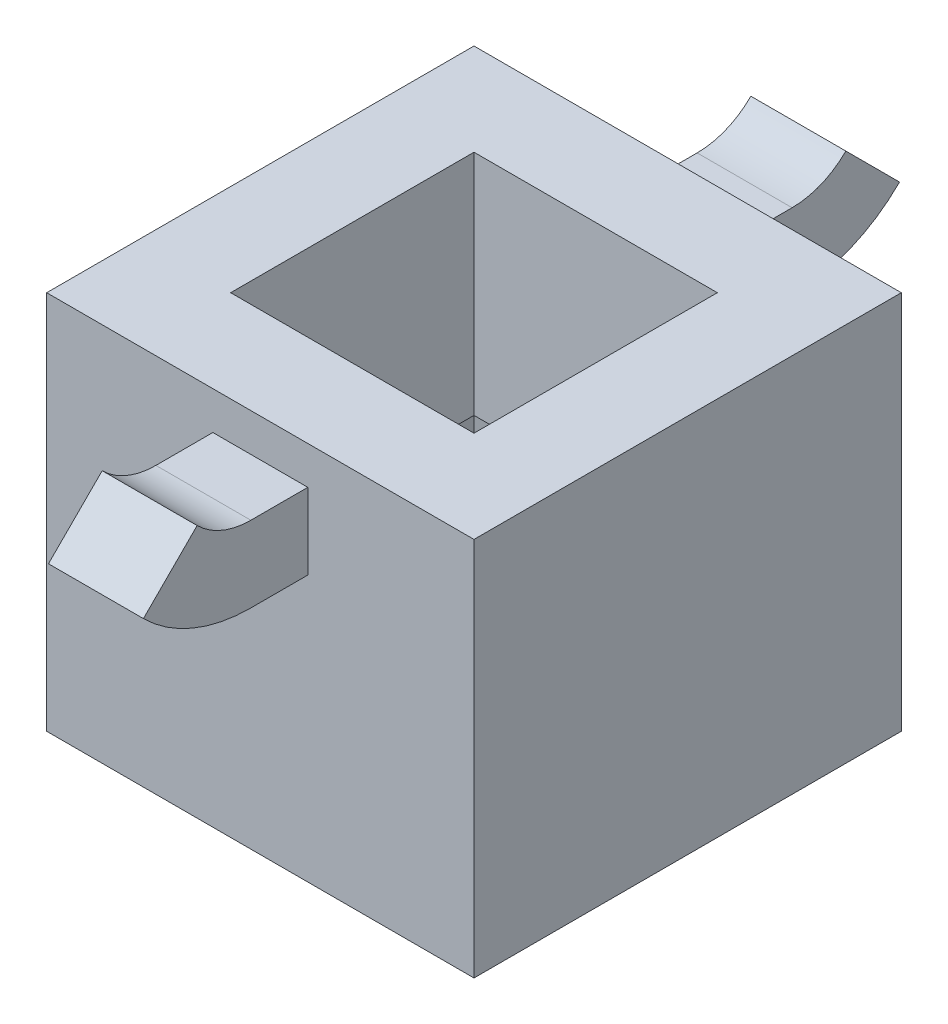
ISO-10303-21;
HEADER;
FILE_DESCRIPTION(('STEP AP214'),'2;1');
FILE_NAME('part.step','',(''),(''),'','','');
FILE_SCHEMA(('AUTOMOTIVE_DESIGN { 1 0 10303 214 1 1 1 1 }'));
ENDSEC;
DATA;
#1=APPLICATION_CONTEXT('core data for automotive mechanical design processes');
#2=APPLICATION_PROTOCOL_DEFINITION('international standard','automotive_design',2000,#1);
#3=PRODUCT_CONTEXT('',#1,'mechanical');
#4=PRODUCT('Part','Part','',(#3));
#5=PRODUCT_RELATED_PRODUCT_CATEGORY('part','',(#4));
#6=PRODUCT_DEFINITION_FORMATION('','',#4);
#7=PRODUCT_DEFINITION_CONTEXT('part definition',#1,'design');
#8=PRODUCT_DEFINITION('design','',#6,#7);
#9=PRODUCT_DEFINITION_SHAPE('','',#8);
#10=(LENGTH_UNIT() NAMED_UNIT(*) SI_UNIT(.MILLI.,.METRE.));
#11=(NAMED_UNIT(*) PLANE_ANGLE_UNIT() SI_UNIT($,.RADIAN.));
#12=(NAMED_UNIT(*) SI_UNIT($,.STERADIAN.) SOLID_ANGLE_UNIT());
#13=UNCERTAINTY_MEASURE_WITH_UNIT(LENGTH_MEASURE(1.E-05),#10,'distance_accuracy_value','');
#14=(GEOMETRIC_REPRESENTATION_CONTEXT(3) GLOBAL_UNCERTAINTY_ASSIGNED_CONTEXT((#13)) GLOBAL_UNIT_ASSIGNED_CONTEXT((#10,
#11,#12)) REPRESENTATION_CONTEXT('',''));
#15=CARTESIAN_POINT('',(0.,0.,0.));
#16=DIRECTION('',(0.,0.,1.));
#17=DIRECTION('',(1.,0.,0.));
#18=AXIS2_PLACEMENT_3D('',#15,#16,#17);
#19=CARTESIAN_POINT('',(11.25,20.,-11.25));
#20=DIRECTION('',(0.,0.,1.));
#21=DIRECTION('',(1.,0.,0.));
#22=AXIS2_PLACEMENT_3D('',#19,#20,#21);
#23=PLANE('',#22);
#24=DIRECTION('',(-1.,0.,0.));
#25=VECTOR('',#24,1.);
#26=CARTESIAN_POINT('',(11.25,0.,-11.25));
#27=LINE('',#26,#25);
#28=CARTESIAN_POINT('',(11.25,0.,-11.25));
#29=VERTEX_POINT('',#28);
#30=CARTESIAN_POINT('',(-11.25,0.,-11.25));
#31=VERTEX_POINT('',#30);
#32=EDGE_CURVE('E398',#29,#31,#27,.T.);
#33=ORIENTED_EDGE('',*,*,#32,.T.);
#34=DIRECTION('',(0.,-1.,0.));
#35=VECTOR('',#34,1.);
#36=CARTESIAN_POINT('',(-11.25,20.,-11.25));
#37=LINE('',#36,#35);
#38=CARTESIAN_POINT('',(-11.25,20.,-11.25));
#39=VERTEX_POINT('',#38);
#40=EDGE_CURVE('E404',#39,#31,#37,.T.);
#41=ORIENTED_EDGE('',*,*,#40,.F.);
#42=DIRECTION('',(-1.,0.,0.));
#43=VECTOR('',#42,1.);
#44=CARTESIAN_POINT('',(11.25,20.,-11.25));
#45=LINE('',#44,#43);
#46=CARTESIAN_POINT('',(11.25,20.,-11.25));
#47=VERTEX_POINT('',#46);
#48=EDGE_CURVE('E402',#47,#39,#45,.T.);
#49=ORIENTED_EDGE('',*,*,#48,.F.);
#50=DIRECTION('',(0.,-1.,0.));
#51=VECTOR('',#50,1.);
#52=CARTESIAN_POINT('',(11.25,20.,-11.25));
#53=LINE('',#52,#51);
#54=EDGE_CURVE('E414',#47,#29,#53,.T.);
#55=ORIENTED_EDGE('',*,*,#54,.T.);
#56=EDGE_LOOP('',(#33,#41,#49,#55));
#57=FACE_BOUND('',#56,.T.);
#58=DIRECTION('',(0.,-1.,0.));
#59=VECTOR('',#58,1.);
#60=CARTESIAN_POINT('',(2.50000000000001,18.,-11.25));
#61=LINE('',#60,#59);
#62=CARTESIAN_POINT('',(2.50000000000001,18.,-11.25));
#63=VERTEX_POINT('',#62);
#64=CARTESIAN_POINT('',(2.50000000000001,14.,-11.25));
#65=VERTEX_POINT('',#64);
#66=EDGE_CURVE('E339',#63,#65,#61,.T.);
#67=ORIENTED_EDGE('',*,*,#66,.F.);
#68=DIRECTION('',(1.,0.,0.));
#69=VECTOR('',#68,1.);
#70=CARTESIAN_POINT('',(-2.49999999999999,18.,-11.25));
#71=LINE('',#70,#69);
#72=CARTESIAN_POINT('',(-2.5,18.,-11.25));
#73=VERTEX_POINT('',#72);
#74=EDGE_CURVE('E344',#73,#63,#71,.T.);
#75=ORIENTED_EDGE('',*,*,#74,.F.);
#76=DIRECTION('',(0.,1.,0.));
#77=VECTOR('',#76,1.);
#78=CARTESIAN_POINT('',(-2.49999999999999,18.,-11.25));
#79=LINE('',#78,#77);
#80=CARTESIAN_POINT('',(-2.5,14.,-11.25));
#81=VERTEX_POINT('',#80);
#82=EDGE_CURVE('E353',#81,#73,#79,.T.);
#83=ORIENTED_EDGE('',*,*,#82,.F.);
#84=DIRECTION('',(-1.,0.,0.));
#85=VECTOR('',#84,1.);
#86=CARTESIAN_POINT('',(-2.49999999999999,14.,-11.25));
#87=LINE('',#86,#85);
#88=EDGE_CURVE('E350',#65,#81,#87,.T.);
#89=ORIENTED_EDGE('',*,*,#88,.F.);
#90=EDGE_LOOP('',(#67,#75,#83,#89));
#91=FACE_BOUND('',#90,.T.);
#92=ADVANCED_FACE('F33',(#57,#91),#23,.F.);
#93=CARTESIAN_POINT('',(-11.25,20.,11.25));
#94=DIRECTION('',(1.,0.,0.));
#95=DIRECTION('',(0.,0.,-1.));
#96=AXIS2_PLACEMENT_3D('',#93,#94,#95);
#97=PLANE('',#96);
#98=DIRECTION('',(0.,0.,1.));
#99=VECTOR('',#98,1.);
#100=CARTESIAN_POINT('',(-11.25,0.,11.25));
#101=LINE('',#100,#99);
#102=CARTESIAN_POINT('',(-11.25,0.,11.25));
#103=VERTEX_POINT('',#102);
#104=EDGE_CURVE('E393',#31,#103,#101,.T.);
#105=ORIENTED_EDGE('',*,*,#104,.T.);
#106=DIRECTION('',(0.,-1.,0.));
#107=VECTOR('',#106,1.);
#108=CARTESIAN_POINT('',(-11.25,20.,11.25));
#109=LINE('',#108,#107);
#110=CARTESIAN_POINT('',(-11.25,20.,11.25));
#111=VERTEX_POINT('',#110);
#112=EDGE_CURVE('E11',#111,#103,#109,.T.);
#113=ORIENTED_EDGE('',*,*,#112,.F.);
#114=DIRECTION('',(0.,0.,1.));
#115=VECTOR('',#114,1.);
#116=CARTESIAN_POINT('',(-11.25,20.,11.25));
#117=LINE('',#116,#115);
#118=EDGE_CURVE('E394',#39,#111,#117,.T.);
#119=ORIENTED_EDGE('',*,*,#118,.F.);
#120=ORIENTED_EDGE('',*,*,#40,.T.);
#121=EDGE_LOOP('',(#105,#113,#119,#120));
#122=FACE_BOUND('',#121,.T.);
#123=ADVANCED_FACE('F35',(#122),#97,.F.);
#124=CARTESIAN_POINT('',(11.25,20.,11.25));
#125=DIRECTION('',(0.,0.,-1.));
#126=DIRECTION('',(-1.,0.,0.));
#127=AXIS2_PLACEMENT_3D('',#124,#125,#126);
#128=PLANE('',#127);
#129=DIRECTION('',(1.,0.,0.));
#130=VECTOR('',#129,1.);
#131=CARTESIAN_POINT('',(-2.49999999999999,18.,11.25));
#132=LINE('',#131,#130);
#133=CARTESIAN_POINT('',(-2.49999999999999,18.,11.25));
#134=VERTEX_POINT('',#133);
#135=CARTESIAN_POINT('',(2.50000000000001,18.,11.25));
#136=VERTEX_POINT('',#135);
#137=EDGE_CURVE('E303',#134,#136,#132,.T.);
#138=ORIENTED_EDGE('',*,*,#137,.T.);
#139=DIRECTION('',(0.,-1.,0.));
#140=VECTOR('',#139,1.);
#141=CARTESIAN_POINT('',(2.50000000000001,18.,11.25));
#142=LINE('',#141,#140);
#143=CARTESIAN_POINT('',(2.5,14.,11.25));
#144=VERTEX_POINT('',#143);
#145=EDGE_CURVE('E275',#136,#144,#142,.T.);
#146=ORIENTED_EDGE('',*,*,#145,.T.);
#147=DIRECTION('',(-1.,0.,0.));
#148=VECTOR('',#147,1.);
#149=CARTESIAN_POINT('',(-2.49999999999999,14.,11.25));
#150=LINE('',#149,#148);
#151=CARTESIAN_POINT('',(-2.5,14.,11.25));
#152=VERTEX_POINT('',#151);
#153=EDGE_CURVE('E297',#144,#152,#150,.T.);
#154=ORIENTED_EDGE('',*,*,#153,.T.);
#155=DIRECTION('',(0.,1.,0.));
#156=VECTOR('',#155,1.);
#157=CARTESIAN_POINT('',(-2.49999999999999,18.,11.25));
#158=LINE('',#157,#156);
#159=EDGE_CURVE('E306',#152,#134,#158,.T.);
#160=ORIENTED_EDGE('',*,*,#159,.T.);
#161=EDGE_LOOP('',(#138,#146,#154,#160));
#162=FACE_BOUND('',#161,.T.);
#163=DIRECTION('',(1.,0.,0.));
#164=VECTOR('',#163,1.);
#165=CARTESIAN_POINT('',(11.25,0.,11.25));
#166=LINE('',#165,#164);
#167=CARTESIAN_POINT('',(11.25,0.,11.25));
#168=VERTEX_POINT('',#167);
#169=EDGE_CURVE('E407',#103,#168,#166,.T.);
#170=ORIENTED_EDGE('',*,*,#169,.T.);
#171=DIRECTION('',(0.,-1.,0.));
#172=VECTOR('',#171,1.);
#173=CARTESIAN_POINT('',(11.25,20.,11.25));
#174=LINE('',#173,#172);
#175=CARTESIAN_POINT('',(11.25,20.,11.25));
#176=VERTEX_POINT('',#175);
#177=EDGE_CURVE('E41',#176,#168,#174,.T.);
#178=ORIENTED_EDGE('',*,*,#177,.F.);
#179=DIRECTION('',(1.,0.,0.));
#180=VECTOR('',#179,1.);
#181=CARTESIAN_POINT('',(11.25,20.,11.25));
#182=LINE('',#181,#180);
#183=EDGE_CURVE('E397',#111,#176,#182,.T.);
#184=ORIENTED_EDGE('',*,*,#183,.F.);
#185=ORIENTED_EDGE('',*,*,#112,.T.);
#186=EDGE_LOOP('',(#170,#178,#184,#185));
#187=FACE_BOUND('',#186,.T.);
#188=ADVANCED_FACE('F435',(#162,#187),#128,.F.);
#189=CARTESIAN_POINT('',(11.25,20.,11.25));
#190=DIRECTION('',(-1.,0.,0.));
#191=DIRECTION('',(0.,0.,1.));
#192=AXIS2_PLACEMENT_3D('',#189,#190,#191);
#193=PLANE('',#192);
#194=DIRECTION('',(0.,0.,-1.));
#195=VECTOR('',#194,1.);
#196=CARTESIAN_POINT('',(11.25,0.,11.25));
#197=LINE('',#196,#195);
#198=EDGE_CURVE('E409',#168,#29,#197,.T.);
#199=ORIENTED_EDGE('',*,*,#198,.T.);
#200=ORIENTED_EDGE('',*,*,#54,.F.);
#201=DIRECTION('',(0.,0.,-1.));
#202=VECTOR('',#201,1.);
#203=CARTESIAN_POINT('',(11.25,20.,11.25));
#204=LINE('',#203,#202);
#205=EDGE_CURVE('E400',#176,#47,#204,.T.);
#206=ORIENTED_EDGE('',*,*,#205,.F.);
#207=ORIENTED_EDGE('',*,*,#177,.T.);
#208=EDGE_LOOP('',(#199,#200,#206,#207));
#209=FACE_BOUND('',#208,.T.);
#210=ADVANCED_FACE('F421',(#209),#193,.F.);
#211=CARTESIAN_POINT('',(0.,20.,0.));
#212=DIRECTION('',(0.,1.,0.));
#213=DIRECTION('',(0.,0.,1.));
#214=AXIS2_PLACEMENT_3D('',#211,#212,#213);
#215=PLANE('',#214);
#216=DIRECTION('',(0.,0.,-1.));
#217=VECTOR('',#216,1.);
#218=CARTESIAN_POINT('',(-6.40675499178565,20.,-6.40675499178565));
#219=LINE('',#218,#217);
#220=CARTESIAN_POINT('',(-6.40675499178565,20.,6.40675499178565));
#221=VERTEX_POINT('',#220);
#222=CARTESIAN_POINT('',(-6.40675499178565,20.,-6.40675499178565));
#223=VERTEX_POINT('',#222);
#224=EDGE_CURVE('E216',#221,#223,#219,.T.);
#225=ORIENTED_EDGE('',*,*,#224,.T.);
#226=DIRECTION('',(1.,0.,0.));
#227=VECTOR('',#226,1.);
#228=CARTESIAN_POINT('',(6.40675499178565,20.,-6.40675499178565));
#229=LINE('',#228,#227);
#230=CARTESIAN_POINT('',(6.40675499178565,20.,-6.40675499178565));
#231=VERTEX_POINT('',#230);
#232=EDGE_CURVE('E205',#223,#231,#229,.T.);
#233=ORIENTED_EDGE('',*,*,#232,.T.);
#234=DIRECTION('',(0.,0.,1.));
#235=VECTOR('',#234,1.);
#236=CARTESIAN_POINT('',(6.40675499178565,20.,-6.40675499178565));
#237=LINE('',#236,#235);
#238=CARTESIAN_POINT('',(6.40675499178565,20.,6.40675499178565));
#239=VERTEX_POINT('',#238);
#240=EDGE_CURVE('E227',#231,#239,#237,.T.);
#241=ORIENTED_EDGE('',*,*,#240,.T.);
#242=DIRECTION('',(-1.,0.,0.));
#243=VECTOR('',#242,1.);
#244=CARTESIAN_POINT('',(6.40675499178565,20.,6.40675499178565));
#245=LINE('',#244,#243);
#246=EDGE_CURVE('E223',#239,#221,#245,.T.);
#247=ORIENTED_EDGE('',*,*,#246,.T.);
#248=EDGE_LOOP('',(#225,#233,#241,#247));
#249=FACE_BOUND('',#248,.T.);
#250=ORIENTED_EDGE('',*,*,#118,.T.);
#251=ORIENTED_EDGE('',*,*,#183,.T.);
#252=ORIENTED_EDGE('',*,*,#205,.T.);
#253=ORIENTED_EDGE('',*,*,#48,.T.);
#254=EDGE_LOOP('',(#250,#251,#252,#253));
#255=FACE_BOUND('',#254,.T.);
#256=ADVANCED_FACE('F221',(#249,#255),#215,.T.);
#257=CARTESIAN_POINT('',(0.,0.,0.));
#258=DIRECTION('',(0.,1.,0.));
#259=DIRECTION('',(0.,0.,1.));
#260=AXIS2_PLACEMENT_3D('',#257,#258,#259);
#261=PLANE('',#260);
#262=DIRECTION('',(-1.,0.,0.));
#263=VECTOR('',#262,1.);
#264=CARTESIAN_POINT('',(-9.25,0.,9.25));
#265=LINE('',#264,#263);
#266=CARTESIAN_POINT('',(9.25,0.,9.25));
#267=VERTEX_POINT('',#266);
#268=CARTESIAN_POINT('',(-9.25,0.,9.25));
#269=VERTEX_POINT('',#268);
#270=EDGE_CURVE('E263',#267,#269,#265,.T.);
#271=ORIENTED_EDGE('',*,*,#270,.F.);
#272=DIRECTION('',(0.,0.,1.));
#273=VECTOR('',#272,1.);
#274=CARTESIAN_POINT('',(9.25,0.,-9.25));
#275=LINE('',#274,#273);
#276=CARTESIAN_POINT('',(9.25,0.,-9.25));
#277=VERTEX_POINT('',#276);
#278=EDGE_CURVE('E255',#277,#267,#275,.T.);
#279=ORIENTED_EDGE('',*,*,#278,.F.);
#280=DIRECTION('',(1.,0.,0.));
#281=VECTOR('',#280,1.);
#282=CARTESIAN_POINT('',(-9.25,0.,-9.25));
#283=LINE('',#282,#281);
#284=CARTESIAN_POINT('',(-9.25,0.,-9.25));
#285=VERTEX_POINT('',#284);
#286=EDGE_CURVE('E269',#285,#277,#283,.T.);
#287=ORIENTED_EDGE('',*,*,#286,.F.);
#288=DIRECTION('',(0.,0.,-1.));
#289=VECTOR('',#288,1.);
#290=CARTESIAN_POINT('',(-9.25,0.,-9.25));
#291=LINE('',#290,#289);
#292=EDGE_CURVE('E266',#269,#285,#291,.T.);
#293=ORIENTED_EDGE('',*,*,#292,.F.);
#294=EDGE_LOOP('',(#271,#279,#287,#293));
#295=FACE_BOUND('',#294,.T.);
#296=ORIENTED_EDGE('',*,*,#104,.F.);
#297=ORIENTED_EDGE('',*,*,#32,.F.);
#298=ORIENTED_EDGE('',*,*,#198,.F.);
#299=ORIENTED_EDGE('',*,*,#169,.F.);
#300=EDGE_LOOP('',(#296,#297,#298,#299));
#301=FACE_BOUND('',#300,.T.);
#302=ADVANCED_FACE('F427',(#295,#301),#261,.F.);
#303=CARTESIAN_POINT('',(0.,22.,-14.25));
#304=DIRECTION('',(1.,0.,0.));
#305=DIRECTION('',(0.,0.,-1.));
#306=AXIS2_PLACEMENT_3D('',#303,#304,#305);
#307=CYLINDRICAL_SURFACE('',#306,8.);
#308=DIRECTION('',(-1.,0.,0.));
#309=VECTOR('',#308,1.);
#310=CARTESIAN_POINT('',(-2.49999999999999,14.,-14.25));
#311=LINE('',#310,#309);
#312=CARTESIAN_POINT('',(2.5,14.,-14.25));
#313=VERTEX_POINT('',#312);
#314=CARTESIAN_POINT('',(-2.49999999999999,14.,-14.25));
#315=VERTEX_POINT('',#314);
#316=EDGE_CURVE('E340',#313,#315,#311,.T.);
#317=ORIENTED_EDGE('',*,*,#316,.T.);
#318=CARTESIAN_POINT('',(-2.49999999999999,22.,-14.25));
#319=DIRECTION('',(1.,0.,0.));
#320=DIRECTION('',(0.,0.,-1.));
#321=AXIS2_PLACEMENT_3D('',#318,#319,#320);
#322=CIRCLE('',#321,8.);
#323=CARTESIAN_POINT('',(-2.49999999999999,16.3431457505076,-19.9068542494923));
#324=VERTEX_POINT('',#323);
#325=EDGE_CURVE('E387',#315,#324,#322,.T.);
#326=ORIENTED_EDGE('',*,*,#325,.T.);
#327=DIRECTION('',(-1.,0.,0.));
#328=VECTOR('',#327,1.);
#329=CARTESIAN_POINT('',(-2.49999999999999,16.3431457505076,-19.9068542494923));
#330=LINE('',#329,#328);
#331=CARTESIAN_POINT('',(2.5,16.3431457505076,-19.9068542494923));
#332=VERTEX_POINT('',#331);
#333=EDGE_CURVE('E378',#332,#324,#330,.T.);
#334=ORIENTED_EDGE('',*,*,#333,.F.);
#335=CARTESIAN_POINT('',(2.5,22.,-14.25));
#336=DIRECTION('',(1.,0.,0.));
#337=DIRECTION('',(0.,0.,-1.));
#338=AXIS2_PLACEMENT_3D('',#335,#336,#337);
#339=CIRCLE('',#338,8.);
#340=EDGE_CURVE('E390',#313,#332,#339,.T.);
#341=ORIENTED_EDGE('',*,*,#340,.F.);
#342=EDGE_LOOP('',(#317,#326,#334,#341));
#343=FACE_BOUND('',#342,.T.);
#344=ADVANCED_FACE('F450',(#343),#307,.T.);
#345=CARTESIAN_POINT('',(0.,22.,-14.25));
#346=DIRECTION('',(1.,0.,0.));
#347=DIRECTION('',(0.,0.,-1.));
#348=AXIS2_PLACEMENT_3D('',#345,#346,#347);
#349=CYLINDRICAL_SURFACE('',#348,4.);
#350=DIRECTION('',(1.,0.,0.));
#351=VECTOR('',#350,1.);
#352=CARTESIAN_POINT('',(-2.49999999999999,18.,-14.25));
#353=LINE('',#352,#351);
#354=CARTESIAN_POINT('',(-2.49999999999999,18.,-14.25));
#355=VERTEX_POINT('',#354);
#356=CARTESIAN_POINT('',(2.50000000000001,18.,-14.25));
#357=VERTEX_POINT('',#356);
#358=EDGE_CURVE('E343',#355,#357,#353,.T.);
#359=ORIENTED_EDGE('',*,*,#358,.T.);
#360=CARTESIAN_POINT('',(2.50000000000001,22.,-14.25));
#361=DIRECTION('',(1.,0.,0.));
#362=DIRECTION('',(0.,0.,-1.));
#363=AXIS2_PLACEMENT_3D('',#360,#361,#362);
#364=CIRCLE('',#363,4.);
#365=CARTESIAN_POINT('',(2.50000000000001,19.1715728752538,-17.0784271247462));
#366=VERTEX_POINT('',#365);
#367=EDGE_CURVE('E381',#357,#366,#364,.T.);
#368=ORIENTED_EDGE('',*,*,#367,.T.);
#369=DIRECTION('',(1.,0.,0.));
#370=VECTOR('',#369,1.);
#371=CARTESIAN_POINT('',(-2.49999999999999,19.1715728752538,-17.0784271247462));
#372=LINE('',#371,#370);
#373=CARTESIAN_POINT('',(-2.49999999999999,19.1715728752538,-17.0784271247462));
#374=VERTEX_POINT('',#373);
#375=EDGE_CURVE('E372',#374,#366,#372,.T.);
#376=ORIENTED_EDGE('',*,*,#375,.F.);
#377=CARTESIAN_POINT('',(-2.49999999999999,22.,-14.25));
#378=DIRECTION('',(1.,0.,0.));
#379=DIRECTION('',(0.,0.,-1.));
#380=AXIS2_PLACEMENT_3D('',#377,#378,#379);
#381=CIRCLE('',#380,4.);
#382=EDGE_CURVE('E384',#355,#374,#381,.T.);
#383=ORIENTED_EDGE('',*,*,#382,.F.);
#384=EDGE_LOOP('',(#359,#368,#376,#383));
#385=FACE_BOUND('',#384,.T.);
#386=ADVANCED_FACE('F456',(#385),#349,.F.);
#387=CARTESIAN_POINT('',(2.50000000000001,18.,-14.25));
#388=DIRECTION('',(-1.,0.,0.));
#389=DIRECTION('',(0.,-1.,0.));
#390=AXIS2_PLACEMENT_3D('',#387,#388,#389);
#391=PLANE('',#390);
#392=ORIENTED_EDGE('',*,*,#66,.T.);
#393=DIRECTION('',(0.,0.,1.));
#394=VECTOR('',#393,1.);
#395=CARTESIAN_POINT('',(2.5,14.,-14.25));
#396=LINE('',#395,#394);
#397=EDGE_CURVE('E366',#313,#65,#396,.T.);
#398=ORIENTED_EDGE('',*,*,#397,.F.);
#399=ORIENTED_EDGE('',*,*,#340,.T.);
#400=DIRECTION('',(0.,-0.707106781186554,-0.707106781186541));
#401=VECTOR('',#400,1.);
#402=CARTESIAN_POINT('',(2.50000000000001,19.1715728752538,-17.0784271247462));
#403=LINE('',#402,#401);
#404=EDGE_CURVE('E369',#366,#332,#403,.T.);
#405=ORIENTED_EDGE('',*,*,#404,.F.);
#406=ORIENTED_EDGE('',*,*,#367,.F.);
#407=DIRECTION('',(0.,0.,1.));
#408=VECTOR('',#407,1.);
#409=CARTESIAN_POINT('',(2.50000000000001,18.,-14.25));
#410=LINE('',#409,#408);
#411=EDGE_CURVE('E347',#357,#63,#410,.T.);
#412=ORIENTED_EDGE('',*,*,#411,.T.);
#413=EDGE_LOOP('',(#392,#398,#399,#405,#406,#412));
#414=FACE_BOUND('',#413,.T.);
#415=ADVANCED_FACE('F460',(#414),#391,.F.);
#416=CARTESIAN_POINT('',(-2.49999999999999,14.,-14.25));
#417=DIRECTION('',(0.,1.,0.));
#418=DIRECTION('',(0.,0.,1.));
#419=AXIS2_PLACEMENT_3D('',#416,#417,#418);
#420=PLANE('',#419);
#421=ORIENTED_EDGE('',*,*,#88,.T.);
#422=DIRECTION('',(0.,0.,1.));
#423=VECTOR('',#422,1.);
#424=CARTESIAN_POINT('',(-2.49999999999999,14.,-14.25));
#425=LINE('',#424,#423);
#426=EDGE_CURVE('E363',#315,#81,#425,.T.);
#427=ORIENTED_EDGE('',*,*,#426,.F.);
#428=ORIENTED_EDGE('',*,*,#316,.F.);
#429=ORIENTED_EDGE('',*,*,#397,.T.);
#430=EDGE_LOOP('',(#421,#427,#428,#429));
#431=FACE_BOUND('',#430,.T.);
#432=ADVANCED_FACE('F464',(#431),#420,.F.);
#433=CARTESIAN_POINT('',(-2.49999999999999,18.,-14.25));
#434=DIRECTION('',(1.,0.,0.));
#435=DIRECTION('',(0.,0.,-1.));
#436=AXIS2_PLACEMENT_3D('',#433,#434,#435);
#437=PLANE('',#436);
#438=ORIENTED_EDGE('',*,*,#82,.T.);
#439=DIRECTION('',(0.,0.,1.));
#440=VECTOR('',#439,1.);
#441=CARTESIAN_POINT('',(-2.49999999999999,18.,-14.25));
#442=LINE('',#441,#440);
#443=EDGE_CURVE('E360',#355,#73,#442,.T.);
#444=ORIENTED_EDGE('',*,*,#443,.F.);
#445=ORIENTED_EDGE('',*,*,#382,.T.);
#446=DIRECTION('',(0.,0.707106781186554,0.707106781186541));
#447=VECTOR('',#446,1.);
#448=CARTESIAN_POINT('',(-2.49999999999999,19.1715728752538,-17.0784271247462));
#449=LINE('',#448,#447);
#450=EDGE_CURVE('E375',#324,#374,#449,.T.);
#451=ORIENTED_EDGE('',*,*,#450,.F.);
#452=ORIENTED_EDGE('',*,*,#325,.F.);
#453=ORIENTED_EDGE('',*,*,#426,.T.);
#454=EDGE_LOOP('',(#438,#444,#445,#451,#452,#453));
#455=FACE_BOUND('',#454,.T.);
#456=ADVANCED_FACE('F468',(#455),#437,.F.);
#457=CARTESIAN_POINT('',(-2.49999999999999,18.,-14.25));
#458=DIRECTION('',(0.,-1.,0.));
#459=DIRECTION('',(0.,0.,-1.));
#460=AXIS2_PLACEMENT_3D('',#457,#458,#459);
#461=PLANE('',#460);
#462=ORIENTED_EDGE('',*,*,#74,.T.);
#463=ORIENTED_EDGE('',*,*,#411,.F.);
#464=ORIENTED_EDGE('',*,*,#358,.F.);
#465=ORIENTED_EDGE('',*,*,#443,.T.);
#466=EDGE_LOOP('',(#462,#463,#464,#465));
#467=FACE_BOUND('',#466,.T.);
#468=ADVANCED_FACE('F472',(#467),#461,.F.);
#469=CARTESIAN_POINT('',(0.,6.4436508138958,-29.8063491861039));
#470=DIRECTION('',(0.,-0.707106781186541,0.707106781186554));
#471=DIRECTION('',(1.,0.,0.));
#472=AXIS2_PLACEMENT_3D('',#469,#470,#471);
#473=PLANE('',#472);
#474=ORIENTED_EDGE('',*,*,#404,.T.);
#475=ORIENTED_EDGE('',*,*,#333,.T.);
#476=ORIENTED_EDGE('',*,*,#450,.T.);
#477=ORIENTED_EDGE('',*,*,#375,.T.);
#478=EDGE_LOOP('',(#474,#475,#476,#477));
#479=FACE_BOUND('',#478,.T.);
#480=ADVANCED_FACE('F476',(#479),#473,.F.);
#481=CARTESIAN_POINT('',(0.,22.,14.25));
#482=DIRECTION('',(-1.,0.,0.));
#483=DIRECTION('',(0.,0.,1.));
#484=AXIS2_PLACEMENT_3D('',#481,#482,#483);
#485=CYLINDRICAL_SURFACE('',#484,4.);
#486=DIRECTION('',(1.,0.,0.));
#487=VECTOR('',#486,1.);
#488=CARTESIAN_POINT('',(-2.49999999999999,18.,14.25));
#489=LINE('',#488,#487);
#490=CARTESIAN_POINT('',(-2.49999999999999,18.,14.25));
#491=VERTEX_POINT('',#490);
#492=CARTESIAN_POINT('',(2.50000000000001,18.,14.25));
#493=VERTEX_POINT('',#492);
#494=EDGE_CURVE('E293',#491,#493,#489,.T.);
#495=ORIENTED_EDGE('',*,*,#494,.F.);
#496=CARTESIAN_POINT('',(-2.49999999999999,22.,14.25));
#497=DIRECTION('',(-1.,0.,0.));
#498=DIRECTION('',(0.,0.,1.));
#499=AXIS2_PLACEMENT_3D('',#496,#497,#498);
#500=CIRCLE('',#499,4.);
#501=CARTESIAN_POINT('',(-2.49999999999999,19.1715728752538,17.0784271247462));
#502=VERTEX_POINT('',#501);
#503=EDGE_CURVE('E333',#491,#502,#500,.T.);
#504=ORIENTED_EDGE('',*,*,#503,.T.);
#505=DIRECTION('',(1.,0.,0.));
#506=VECTOR('',#505,1.);
#507=CARTESIAN_POINT('',(-2.49999999999999,19.1715728752538,17.0784271247462));
#508=LINE('',#507,#506);
#509=CARTESIAN_POINT('',(2.50000000000001,19.1715728752538,17.0784271247462));
#510=VERTEX_POINT('',#509);
#511=EDGE_CURVE('E325',#502,#510,#508,.T.);
#512=ORIENTED_EDGE('',*,*,#511,.T.);
#513=CARTESIAN_POINT('',(2.50000000000001,22.,14.25));
#514=DIRECTION('',(-1.,0.,0.));
#515=DIRECTION('',(0.,0.,1.));
#516=AXIS2_PLACEMENT_3D('',#513,#514,#515);
#517=CIRCLE('',#516,4.);
#518=EDGE_CURVE('E336',#493,#510,#517,.T.);
#519=ORIENTED_EDGE('',*,*,#518,.F.);
#520=EDGE_LOOP('',(#495,#504,#512,#519));
#521=FACE_BOUND('',#520,.T.);
#522=ADVANCED_FACE('F480',(#521),#485,.F.);
#523=CARTESIAN_POINT('',(0.,22.,14.25));
#524=DIRECTION('',(-1.,0.,0.));
#525=DIRECTION('',(0.,0.,1.));
#526=AXIS2_PLACEMENT_3D('',#523,#524,#525);
#527=CYLINDRICAL_SURFACE('',#526,8.);
#528=DIRECTION('',(-1.,0.,0.));
#529=VECTOR('',#528,1.);
#530=CARTESIAN_POINT('',(-2.49999999999999,14.,14.25));
#531=LINE('',#530,#529);
#532=CARTESIAN_POINT('',(2.5,14.,14.25));
#533=VERTEX_POINT('',#532);
#534=CARTESIAN_POINT('',(-2.49999999999999,14.,14.25));
#535=VERTEX_POINT('',#534);
#536=EDGE_CURVE('E296',#533,#535,#531,.T.);
#537=ORIENTED_EDGE('',*,*,#536,.F.);
#538=CARTESIAN_POINT('',(2.5,22.,14.25));
#539=DIRECTION('',(-1.,0.,0.));
#540=DIRECTION('',(0.,0.,1.));
#541=AXIS2_PLACEMENT_3D('',#538,#539,#540);
#542=CIRCLE('',#541,8.);
#543=CARTESIAN_POINT('',(2.5,16.3431457505076,19.9068542494923));
#544=VERTEX_POINT('',#543);
#545=EDGE_CURVE('E327',#533,#544,#542,.T.);
#546=ORIENTED_EDGE('',*,*,#545,.T.);
#547=DIRECTION('',(-1.,0.,0.));
#548=VECTOR('',#547,1.);
#549=CARTESIAN_POINT('',(-2.49999999999999,16.3431457505076,19.9068542494923));
#550=LINE('',#549,#548);
#551=CARTESIAN_POINT('',(-2.49999999999999,16.3431457505076,19.9068542494923));
#552=VERTEX_POINT('',#551);
#553=EDGE_CURVE('E321',#544,#552,#550,.T.);
#554=ORIENTED_EDGE('',*,*,#553,.T.);
#555=CARTESIAN_POINT('',(-2.49999999999999,22.,14.25));
#556=DIRECTION('',(-1.,0.,0.));
#557=DIRECTION('',(0.,0.,1.));
#558=AXIS2_PLACEMENT_3D('',#555,#556,#557);
#559=CIRCLE('',#558,8.);
#560=EDGE_CURVE('E330',#535,#552,#559,.T.);
#561=ORIENTED_EDGE('',*,*,#560,.F.);
#562=EDGE_LOOP('',(#537,#546,#554,#561));
#563=FACE_BOUND('',#562,.T.);
#564=ADVANCED_FACE('F484',(#563),#527,.T.);
#565=CARTESIAN_POINT('',(2.50000000000001,18.,14.25));
#566=DIRECTION('',(1.,0.,0.));
#567=DIRECTION('',(0.,1.,0.));
#568=AXIS2_PLACEMENT_3D('',#565,#566,#567);
#569=PLANE('',#568);
#570=ORIENTED_EDGE('',*,*,#145,.F.);
#571=DIRECTION('',(0.,0.,-1.));
#572=VECTOR('',#571,1.);
#573=CARTESIAN_POINT('',(2.50000000000001,18.,14.25));
#574=LINE('',#573,#572);
#575=EDGE_CURVE('E317',#493,#136,#574,.T.);
#576=ORIENTED_EDGE('',*,*,#575,.F.);
#577=ORIENTED_EDGE('',*,*,#518,.T.);
#578=DIRECTION('',(0.,-0.707106781186554,0.707106781186541));
#579=VECTOR('',#578,1.);
#580=CARTESIAN_POINT('',(2.50000000000001,19.1715728752538,17.0784271247462));
#581=LINE('',#580,#579);
#582=EDGE_CURVE('E319',#510,#544,#581,.T.);
#583=ORIENTED_EDGE('',*,*,#582,.T.);
#584=ORIENTED_EDGE('',*,*,#545,.F.);
#585=DIRECTION('',(0.,0.,-1.));
#586=VECTOR('',#585,1.);
#587=CARTESIAN_POINT('',(2.5,14.,14.25));
#588=LINE('',#587,#586);
#589=EDGE_CURVE('E300',#533,#144,#588,.T.);
#590=ORIENTED_EDGE('',*,*,#589,.T.);
#591=EDGE_LOOP('',(#570,#576,#577,#583,#584,#590));
#592=FACE_BOUND('',#591,.T.);
#593=ADVANCED_FACE('F488',(#592),#569,.T.);
#594=CARTESIAN_POINT('',(-2.49999999999999,18.,14.25));
#595=DIRECTION('',(0.,1.,0.));
#596=DIRECTION('',(0.,0.,1.));
#597=AXIS2_PLACEMENT_3D('',#594,#595,#596);
#598=PLANE('',#597);
#599=ORIENTED_EDGE('',*,*,#137,.F.);
#600=DIRECTION('',(0.,0.,-1.));
#601=VECTOR('',#600,1.);
#602=CARTESIAN_POINT('',(-2.49999999999999,18.,14.25));
#603=LINE('',#602,#601);
#604=EDGE_CURVE('E315',#491,#134,#603,.T.);
#605=ORIENTED_EDGE('',*,*,#604,.F.);
#606=ORIENTED_EDGE('',*,*,#494,.T.);
#607=ORIENTED_EDGE('',*,*,#575,.T.);
#608=EDGE_LOOP('',(#599,#605,#606,#607));
#609=FACE_BOUND('',#608,.T.);
#610=ADVANCED_FACE('F492',(#609),#598,.T.);
#611=CARTESIAN_POINT('',(-2.49999999999999,18.,14.25));
#612=DIRECTION('',(-1.,0.,0.));
#613=DIRECTION('',(0.,0.,1.));
#614=AXIS2_PLACEMENT_3D('',#611,#612,#613);
#615=PLANE('',#614);
#616=ORIENTED_EDGE('',*,*,#159,.F.);
#617=DIRECTION('',(0.,0.,-1.));
#618=VECTOR('',#617,1.);
#619=CARTESIAN_POINT('',(-2.49999999999999,14.,14.25));
#620=LINE('',#619,#618);
#621=EDGE_CURVE('E312',#535,#152,#620,.T.);
#622=ORIENTED_EDGE('',*,*,#621,.F.);
#623=ORIENTED_EDGE('',*,*,#560,.T.);
#624=DIRECTION('',(0.,0.707106781186554,-0.707106781186541));
#625=VECTOR('',#624,1.);
#626=CARTESIAN_POINT('',(-2.49999999999999,19.1715728752538,17.0784271247462));
#627=LINE('',#626,#625);
#628=EDGE_CURVE('E323',#552,#502,#627,.T.);
#629=ORIENTED_EDGE('',*,*,#628,.T.);
#630=ORIENTED_EDGE('',*,*,#503,.F.);
#631=ORIENTED_EDGE('',*,*,#604,.T.);
#632=EDGE_LOOP('',(#616,#622,#623,#629,#630,#631));
#633=FACE_BOUND('',#632,.T.);
#634=ADVANCED_FACE('F496',(#633),#615,.T.);
#635=CARTESIAN_POINT('',(-2.49999999999999,14.,14.25));
#636=DIRECTION('',(0.,-1.,0.));
#637=DIRECTION('',(0.,0.,-1.));
#638=AXIS2_PLACEMENT_3D('',#635,#636,#637);
#639=PLANE('',#638);
#640=ORIENTED_EDGE('',*,*,#153,.F.);
#641=ORIENTED_EDGE('',*,*,#589,.F.);
#642=ORIENTED_EDGE('',*,*,#536,.T.);
#643=ORIENTED_EDGE('',*,*,#621,.T.);
#644=EDGE_LOOP('',(#640,#641,#642,#643));
#645=FACE_BOUND('',#644,.T.);
#646=ADVANCED_FACE('F500',(#645),#639,.T.);
#647=CARTESIAN_POINT('',(0.,6.4436508138958,29.8063491861039));
#648=DIRECTION('',(0.,-0.707106781186541,-0.707106781186554));
#649=DIRECTION('',(1.,0.,0.));
#650=AXIS2_PLACEMENT_3D('',#647,#648,#649);
#651=PLANE('',#650);
#652=ORIENTED_EDGE('',*,*,#582,.F.);
#653=ORIENTED_EDGE('',*,*,#511,.F.);
#654=ORIENTED_EDGE('',*,*,#628,.F.);
#655=ORIENTED_EDGE('',*,*,#553,.F.);
#656=EDGE_LOOP('',(#652,#653,#654,#655));
#657=FACE_BOUND('',#656,.T.);
#658=ADVANCED_FACE('F504',(#657),#651,.F.);
#659=CARTESIAN_POINT('',(9.25,0.,-9.25));
#660=DIRECTION('',(0.99026806874157,0.139173100960065,0.));
#661=DIRECTION('',(-0.139173100960065,0.99026806874157,0.));
#662=AXIS2_PLACEMENT_3D('',#659,#660,#661);
#663=PLANE('',#662);
#664=ORIENTED_EDGE('',*,*,#278,.T.);
#665=DIRECTION('',(0.137844537491629,-0.980814848463989,0.137844537491629));
#666=VECTOR('',#665,1.);
#667=CARTESIAN_POINT('',(8.8984793444488,2.50119942930165,8.8984793444488));
#668=LINE('',#667,#666);
#669=CARTESIAN_POINT('',(8.40675499178565,6.,8.40675499178565));
#670=VERTEX_POINT('',#669);
#671=EDGE_CURVE('E277',#670,#267,#668,.T.);
#672=ORIENTED_EDGE('',*,*,#671,.F.);
#673=DIRECTION('',(0.,0.,1.));
#674=VECTOR('',#673,1.);
#675=CARTESIAN_POINT('',(8.40675499178565,6.,-9.25));
#676=LINE('',#675,#674);
#677=CARTESIAN_POINT('',(8.40675499178565,6.,-8.40675499178565));
#678=VERTEX_POINT('',#677);
#679=EDGE_CURVE('E272',#678,#670,#676,.T.);
#680=ORIENTED_EDGE('',*,*,#679,.F.);
#681=DIRECTION('',(0.137844537491629,-0.980814848463989,-0.137844537491629));
#682=VECTOR('',#681,1.);
#683=CARTESIAN_POINT('',(8.8984793444488,2.50119942930165,-8.8984793444488));
#684=LINE('',#683,#682);
#685=EDGE_CURVE('E273',#678,#277,#684,.T.);
#686=ORIENTED_EDGE('',*,*,#685,.T.);
#687=EDGE_LOOP('',(#664,#672,#680,#686));
#688=FACE_BOUND('',#687,.T.);
#689=ADVANCED_FACE('F508',(#688),#663,.F.);
#690=CARTESIAN_POINT('',(-9.25,0.,-9.25));
#691=DIRECTION('',(0.,0.139173100960065,-0.99026806874157));
#692=DIRECTION('',(0.,0.99026806874157,0.139173100960065));
#693=AXIS2_PLACEMENT_3D('',#690,#691,#692);
#694=PLANE('',#693);
#695=ORIENTED_EDGE('',*,*,#286,.T.);
#696=ORIENTED_EDGE('',*,*,#685,.F.);
#697=DIRECTION('',(1.,0.,0.));
#698=VECTOR('',#697,1.);
#699=CARTESIAN_POINT('',(-9.25,6.,-8.40675499178565));
#700=LINE('',#699,#698);
#701=CARTESIAN_POINT('',(-8.40675499178565,6.,-8.40675499178565));
#702=VERTEX_POINT('',#701);
#703=EDGE_CURVE('E281',#702,#678,#700,.T.);
#704=ORIENTED_EDGE('',*,*,#703,.F.);
#705=DIRECTION('',(-0.137844537491629,-0.980814848463989,-0.137844537491629));
#706=VECTOR('',#705,1.);
#707=CARTESIAN_POINT('',(-9.25,0.,-9.25));
#708=LINE('',#707,#706);
#709=EDGE_CURVE('E276',#702,#285,#708,.T.);
#710=ORIENTED_EDGE('',*,*,#709,.T.);
#711=EDGE_LOOP('',(#695,#696,#704,#710));
#712=FACE_BOUND('',#711,.T.);
#713=ADVANCED_FACE('F510',(#712),#694,.F.);
#714=CARTESIAN_POINT('',(-9.25,0.,-9.25));
#715=DIRECTION('',(-0.99026806874157,0.139173100960065,0.));
#716=DIRECTION('',(-0.139173100960065,-0.99026806874157,0.));
#717=AXIS2_PLACEMENT_3D('',#714,#715,#716);
#718=PLANE('',#717);
#719=ORIENTED_EDGE('',*,*,#292,.T.);
#720=ORIENTED_EDGE('',*,*,#709,.F.);
#721=DIRECTION('',(0.,0.,-1.));
#722=VECTOR('',#721,1.);
#723=CARTESIAN_POINT('',(-8.40675499178565,6.,-9.25));
#724=LINE('',#723,#722);
#725=CARTESIAN_POINT('',(-8.40675499178565,6.,8.40675499178565));
#726=VERTEX_POINT('',#725);
#727=EDGE_CURVE('E289',#726,#702,#724,.T.);
#728=ORIENTED_EDGE('',*,*,#727,.F.);
#729=DIRECTION('',(-0.137844537491629,-0.980814848463989,0.137844537491629));
#730=VECTOR('',#729,1.);
#731=CARTESIAN_POINT('',(-9.25,0.,9.25));
#732=LINE('',#731,#730);
#733=EDGE_CURVE('E280',#726,#269,#732,.T.);
#734=ORIENTED_EDGE('',*,*,#733,.T.);
#735=EDGE_LOOP('',(#719,#720,#728,#734));
#736=FACE_BOUND('',#735,.T.);
#737=ADVANCED_FACE('F513',(#736),#718,.F.);
#738=CARTESIAN_POINT('',(-9.25,0.,9.25));
#739=DIRECTION('',(0.,0.139173100960065,0.99026806874157));
#740=DIRECTION('',(0.,-0.99026806874157,0.139173100960065));
#741=AXIS2_PLACEMENT_3D('',#738,#739,#740);
#742=PLANE('',#741);
#743=ORIENTED_EDGE('',*,*,#270,.T.);
#744=ORIENTED_EDGE('',*,*,#733,.F.);
#745=DIRECTION('',(-1.,0.,0.));
#746=VECTOR('',#745,1.);
#747=CARTESIAN_POINT('',(-9.25,6.,8.40675499178565));
#748=LINE('',#747,#746);
#749=EDGE_CURVE('E286',#670,#726,#748,.T.);
#750=ORIENTED_EDGE('',*,*,#749,.F.);
#751=ORIENTED_EDGE('',*,*,#671,.T.);
#752=EDGE_LOOP('',(#743,#744,#750,#751));
#753=FACE_BOUND('',#752,.T.);
#754=ADVANCED_FACE('F517',(#753),#742,.F.);
#755=CARTESIAN_POINT('',(-8.40675499178565,8.,8.40675499178565));
#756=DIRECTION('',(-1.,0.,0.));
#757=DIRECTION('',(0.,0.,1.));
#758=AXIS2_PLACEMENT_3D('',#755,#756,#757);
#759=PLANE('',#758);
#760=ORIENTED_EDGE('',*,*,#727,.T.);
#761=DIRECTION('',(0.,-1.,0.));
#762=VECTOR('',#761,1.);
#763=CARTESIAN_POINT('',(-8.40675499178565,8.,-8.40675499178565));
#764=LINE('',#763,#762);
#765=CARTESIAN_POINT('',(-8.40675499178565,8.,-8.40675499178565));
#766=VERTEX_POINT('',#765);
#767=EDGE_CURVE('E252',#766,#702,#764,.T.);
#768=ORIENTED_EDGE('',*,*,#767,.F.);
#769=DIRECTION('',(0.,0.,-1.));
#770=VECTOR('',#769,1.);
#771=CARTESIAN_POINT('',(-8.40675499178565,8.,8.40675499178565));
#772=LINE('',#771,#770);
#773=CARTESIAN_POINT('',(-8.40675499178565,8.,8.40675499178565));
#774=VERTEX_POINT('',#773);
#775=EDGE_CURVE('E212',#774,#766,#772,.T.);
#776=ORIENTED_EDGE('',*,*,#775,.F.);
#777=DIRECTION('',(0.,-1.,0.));
#778=VECTOR('',#777,1.);
#779=CARTESIAN_POINT('',(-8.40675499178565,8.,8.40675499178565));
#780=LINE('',#779,#778);
#781=EDGE_CURVE('E253',#774,#726,#780,.T.);
#782=ORIENTED_EDGE('',*,*,#781,.T.);
#783=EDGE_LOOP('',(#760,#768,#776,#782));
#784=FACE_BOUND('',#783,.T.);
#785=ADVANCED_FACE('F521',(#784),#759,.F.);
#786=CARTESIAN_POINT('',(8.40675499178565,8.,8.40675499178565));
#787=DIRECTION('',(0.,0.,1.));
#788=DIRECTION('',(1.,0.,0.));
#789=AXIS2_PLACEMENT_3D('',#786,#787,#788);
#790=PLANE('',#789);
#791=ORIENTED_EDGE('',*,*,#749,.T.);
#792=ORIENTED_EDGE('',*,*,#781,.F.);
#793=DIRECTION('',(-1.,0.,0.));
#794=VECTOR('',#793,1.);
#795=CARTESIAN_POINT('',(8.40675499178565,8.,8.40675499178565));
#796=LINE('',#795,#794);
#797=CARTESIAN_POINT('',(8.40675499178565,8.,8.40675499178565));
#798=VERTEX_POINT('',#797);
#799=EDGE_CURVE('E249',#798,#774,#796,.T.);
#800=ORIENTED_EDGE('',*,*,#799,.F.);
#801=DIRECTION('',(0.,-1.,0.));
#802=VECTOR('',#801,1.);
#803=CARTESIAN_POINT('',(8.40675499178565,8.,8.40675499178565));
#804=LINE('',#803,#802);
#805=EDGE_CURVE('E256',#798,#670,#804,.T.);
#806=ORIENTED_EDGE('',*,*,#805,.T.);
#807=EDGE_LOOP('',(#791,#792,#800,#806));
#808=FACE_BOUND('',#807,.T.);
#809=ADVANCED_FACE('F528',(#808),#790,.F.);
#810=CARTESIAN_POINT('',(8.40675499178565,8.,8.40675499178565));
#811=DIRECTION('',(1.,0.,0.));
#812=DIRECTION('',(0.,0.,-1.));
#813=AXIS2_PLACEMENT_3D('',#810,#811,#812);
#814=PLANE('',#813);
#815=ORIENTED_EDGE('',*,*,#679,.T.);
#816=ORIENTED_EDGE('',*,*,#805,.F.);
#817=DIRECTION('',(0.,0.,1.));
#818=VECTOR('',#817,1.);
#819=CARTESIAN_POINT('',(8.40675499178565,8.,8.40675499178565));
#820=LINE('',#819,#818);
#821=CARTESIAN_POINT('',(8.40675499178565,8.,-8.40675499178565));
#822=VERTEX_POINT('',#821);
#823=EDGE_CURVE('E246',#822,#798,#820,.T.);
#824=ORIENTED_EDGE('',*,*,#823,.F.);
#825=DIRECTION('',(0.,-1.,0.));
#826=VECTOR('',#825,1.);
#827=CARTESIAN_POINT('',(8.40675499178565,8.,-8.40675499178565));
#828=LINE('',#827,#826);
#829=EDGE_CURVE('E258',#822,#678,#828,.T.);
#830=ORIENTED_EDGE('',*,*,#829,.T.);
#831=EDGE_LOOP('',(#815,#816,#824,#830));
#832=FACE_BOUND('',#831,.T.);
#833=ADVANCED_FACE('F534',(#832),#814,.F.);
#834=CARTESIAN_POINT('',(8.40675499178565,8.,-8.40675499178565));
#835=DIRECTION('',(0.,0.,-1.));
#836=DIRECTION('',(-1.,0.,0.));
#837=AXIS2_PLACEMENT_3D('',#834,#835,#836);
#838=PLANE('',#837);
#839=ORIENTED_EDGE('',*,*,#703,.T.);
#840=ORIENTED_EDGE('',*,*,#829,.F.);
#841=DIRECTION('',(1.,0.,0.));
#842=VECTOR('',#841,1.);
#843=CARTESIAN_POINT('',(8.40675499178565,8.,-8.40675499178565));
#844=LINE('',#843,#842);
#845=EDGE_CURVE('E243',#766,#822,#844,.T.);
#846=ORIENTED_EDGE('',*,*,#845,.F.);
#847=ORIENTED_EDGE('',*,*,#767,.T.);
#848=EDGE_LOOP('',(#839,#840,#846,#847));
#849=FACE_BOUND('',#848,.T.);
#850=ADVANCED_FACE('F530',(#849),#838,.F.);
#851=CARTESIAN_POINT('',(0.,8.,0.));
#852=DIRECTION('',(0.,1.,0.));
#853=DIRECTION('',(0.,0.,1.));
#854=AXIS2_PLACEMENT_3D('',#851,#852,#853);
#855=PLANE('',#854);
#856=DIRECTION('',(1.,0.,0.));
#857=VECTOR('',#856,1.);
#858=CARTESIAN_POINT('',(6.40675499178565,8.,-6.40675499178565));
#859=LINE('',#858,#857);
#860=CARTESIAN_POINT('',(-6.40675499178565,8.,-6.40675499178565));
#861=VERTEX_POINT('',#860);
#862=CARTESIAN_POINT('',(6.40675499178565,8.,-6.40675499178565));
#863=VERTEX_POINT('',#862);
#864=EDGE_CURVE('E225',#861,#863,#859,.T.);
#865=ORIENTED_EDGE('',*,*,#864,.F.);
#866=DIRECTION('',(0.,0.,-1.));
#867=VECTOR('',#866,1.);
#868=CARTESIAN_POINT('',(-6.40675499178565,8.,-6.40675499178565));
#869=LINE('',#868,#867);
#870=CARTESIAN_POINT('',(-6.40675499178565,8.,6.40675499178565));
#871=VERTEX_POINT('',#870);
#872=EDGE_CURVE('E56',#871,#861,#869,.T.);
#873=ORIENTED_EDGE('',*,*,#872,.F.);
#874=DIRECTION('',(-1.,0.,0.));
#875=VECTOR('',#874,1.);
#876=CARTESIAN_POINT('',(6.40675499178565,8.,6.40675499178565));
#877=LINE('',#876,#875);
#878=CARTESIAN_POINT('',(6.40675499178565,8.,6.40675499178565));
#879=VERTEX_POINT('',#878);
#880=EDGE_CURVE('E218',#879,#871,#877,.T.);
#881=ORIENTED_EDGE('',*,*,#880,.F.);
#882=DIRECTION('',(0.,0.,1.));
#883=VECTOR('',#882,1.);
#884=CARTESIAN_POINT('',(6.40675499178565,8.,-6.40675499178565));
#885=LINE('',#884,#883);
#886=EDGE_CURVE('E232',#863,#879,#885,.T.);
#887=ORIENTED_EDGE('',*,*,#886,.F.);
#888=EDGE_LOOP('',(#865,#873,#881,#887));
#889=FACE_BOUND('',#888,.T.);
#890=ORIENTED_EDGE('',*,*,#775,.T.);
#891=ORIENTED_EDGE('',*,*,#845,.T.);
#892=ORIENTED_EDGE('',*,*,#823,.T.);
#893=ORIENTED_EDGE('',*,*,#799,.T.);
#894=EDGE_LOOP('',(#890,#891,#892,#893));
#895=FACE_BOUND('',#894,.T.);
#896=ADVANCED_FACE('F533',(#889,#895),#855,.F.);
#897=CARTESIAN_POINT('',(-6.40675499178565,20.001,-6.40675499178565));
#898=DIRECTION('',(-1.,0.,0.));
#899=DIRECTION('',(0.,0.,1.));
#900=AXIS2_PLACEMENT_3D('',#897,#898,#899);
#901=PLANE('',#900);
#902=DIRECTION('',(0.,-1.,0.));
#903=VECTOR('',#902,1.);
#904=CARTESIAN_POINT('',(-6.40675499178565,20.001,6.40675499178565));
#905=LINE('',#904,#903);
#906=EDGE_CURVE('E213',#221,#871,#905,.T.);
#907=ORIENTED_EDGE('',*,*,#906,.T.);
#908=ORIENTED_EDGE('',*,*,#872,.T.);
#909=DIRECTION('',(0.,-1.,0.));
#910=VECTOR('',#909,1.);
#911=CARTESIAN_POINT('',(-6.40675499178565,20.001,-6.40675499178565));
#912=LINE('',#911,#910);
#913=EDGE_CURVE('E207',#223,#861,#912,.T.);
#914=ORIENTED_EDGE('',*,*,#913,.F.);
#915=ORIENTED_EDGE('',*,*,#224,.F.);
#916=EDGE_LOOP('',(#907,#908,#914,#915));
#917=FACE_BOUND('',#916,.T.);
#918=ADVANCED_FACE('F215',(#917),#901,.F.);
#919=CARTESIAN_POINT('',(6.40675499178565,20.001,6.40675499178565));
#920=DIRECTION('',(0.,0.,1.));
#921=DIRECTION('',(1.,0.,0.));
#922=AXIS2_PLACEMENT_3D('',#919,#920,#921);
#923=PLANE('',#922);
#924=DIRECTION('',(0.,-1.,0.));
#925=VECTOR('',#924,1.);
#926=CARTESIAN_POINT('',(6.40675499178565,20.001,6.40675499178565));
#927=LINE('',#926,#925);
#928=EDGE_CURVE('E238',#239,#879,#927,.T.);
#929=ORIENTED_EDGE('',*,*,#928,.T.);
#930=ORIENTED_EDGE('',*,*,#880,.T.);
#931=ORIENTED_EDGE('',*,*,#906,.F.);
#932=ORIENTED_EDGE('',*,*,#246,.F.);
#933=EDGE_LOOP('',(#929,#930,#931,#932));
#934=FACE_BOUND('',#933,.T.);
#935=ADVANCED_FACE('F547',(#934),#923,.F.);
#936=CARTESIAN_POINT('',(6.40675499178565,20.001,-6.40675499178565));
#937=DIRECTION('',(1.,0.,0.));
#938=DIRECTION('',(0.,0.,-1.));
#939=AXIS2_PLACEMENT_3D('',#936,#937,#938);
#940=PLANE('',#939);
#941=DIRECTION('',(0.,-1.,0.));
#942=VECTOR('',#941,1.);
#943=CARTESIAN_POINT('',(6.40675499178565,20.001,-6.40675499178565));
#944=LINE('',#943,#942);
#945=EDGE_CURVE('E48',#231,#863,#944,.T.);
#946=ORIENTED_EDGE('',*,*,#945,.T.);
#947=ORIENTED_EDGE('',*,*,#886,.T.);
#948=ORIENTED_EDGE('',*,*,#928,.F.);
#949=ORIENTED_EDGE('',*,*,#240,.F.);
#950=EDGE_LOOP('',(#946,#947,#948,#949));
#951=FACE_BOUND('',#950,.T.);
#952=ADVANCED_FACE('F550',(#951),#940,.F.);
#953=CARTESIAN_POINT('',(6.40675499178565,20.001,-6.40675499178565));
#954=DIRECTION('',(0.,0.,-1.));
#955=DIRECTION('',(-1.,0.,0.));
#956=AXIS2_PLACEMENT_3D('',#953,#954,#955);
#957=PLANE('',#956);
#958=ORIENTED_EDGE('',*,*,#913,.T.);
#959=ORIENTED_EDGE('',*,*,#864,.T.);
#960=ORIENTED_EDGE('',*,*,#945,.F.);
#961=ORIENTED_EDGE('',*,*,#232,.F.);
#962=EDGE_LOOP('',(#958,#959,#960,#961));
#963=FACE_BOUND('',#962,.T.);
#964=ADVANCED_FACE('F206',(#963),#957,.F.);
#965=CLOSED_SHELL('',(#92,#123,#188,#210,#256,#302,#344,#386,#415,#432,#456,#468,#480,#522,#564,
#593,#610,#634,#646,#658,#689,#713,#737,#754,#785,#809,#833,#850,#896,#918,#935,#952,#964));
#966=MANIFOLD_SOLID_BREP('B2',#965);
#967=ADVANCED_BREP_SHAPE_REPRESENTATION('',(#18,#966),#14);
#968=SHAPE_DEFINITION_REPRESENTATION(#9,#967);
ENDSEC;
END-ISO-10303-21;
